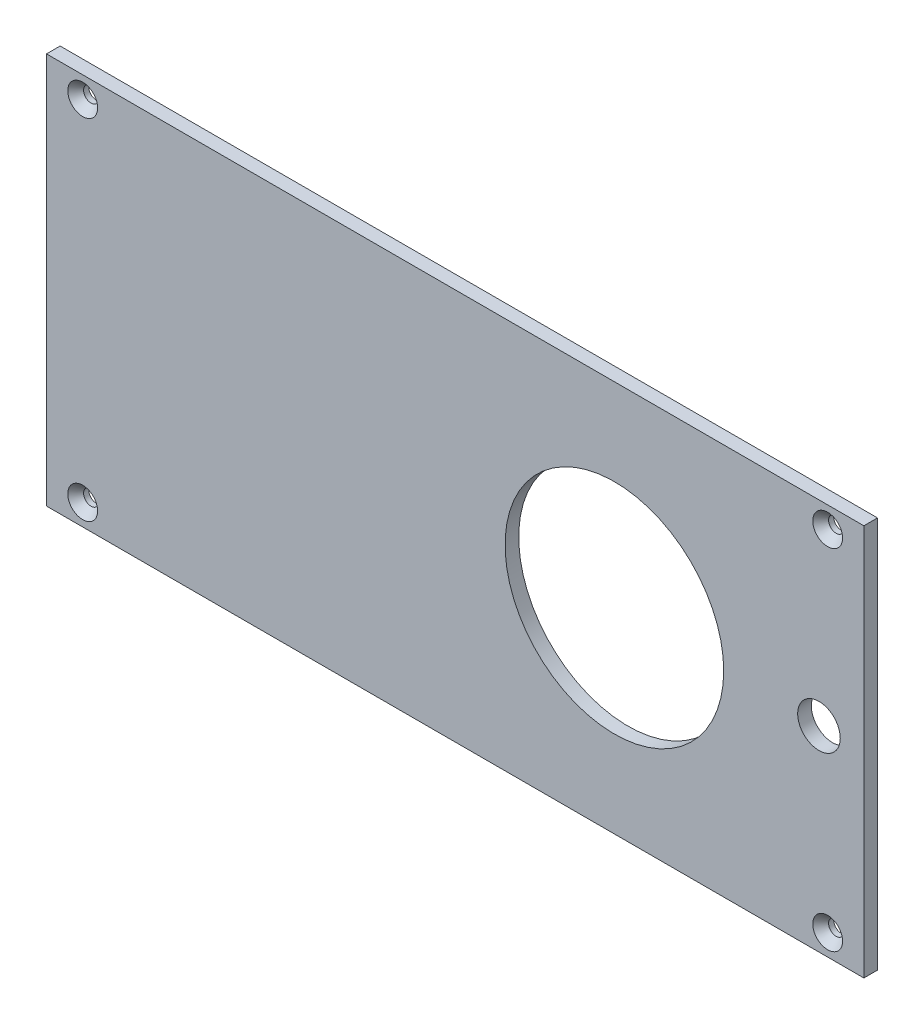
ISO-10303-21;
HEADER;
FILE_DESCRIPTION(('STEP AP214'),'2;1');
FILE_NAME('part.step','',(''),(''),'','','');
FILE_SCHEMA(('AUTOMOTIVE_DESIGN { 1 0 10303 214 1 1 1 1 }'));
ENDSEC;
DATA;
#1=APPLICATION_CONTEXT('core data for automotive mechanical design processes');
#2=APPLICATION_PROTOCOL_DEFINITION('international standard','automotive_design',2000,#1);
#3=PRODUCT_CONTEXT('',#1,'mechanical');
#4=PRODUCT('Part','Part','',(#3));
#5=PRODUCT_RELATED_PRODUCT_CATEGORY('part','',(#4));
#6=PRODUCT_DEFINITION_FORMATION('','',#4);
#7=PRODUCT_DEFINITION_CONTEXT('part definition',#1,'design');
#8=PRODUCT_DEFINITION('design','',#6,#7);
#9=PRODUCT_DEFINITION_SHAPE('','',#8);
#10=(LENGTH_UNIT() NAMED_UNIT(*) SI_UNIT(.MILLI.,.METRE.));
#11=(NAMED_UNIT(*) PLANE_ANGLE_UNIT() SI_UNIT($,.RADIAN.));
#12=(NAMED_UNIT(*) SI_UNIT($,.STERADIAN.) SOLID_ANGLE_UNIT());
#13=UNCERTAINTY_MEASURE_WITH_UNIT(LENGTH_MEASURE(1.E-05),#10,'distance_accuracy_value','');
#14=(GEOMETRIC_REPRESENTATION_CONTEXT(3) GLOBAL_UNCERTAINTY_ASSIGNED_CONTEXT((#13)) GLOBAL_UNIT_ASSIGNED_CONTEXT((#10,
#11,#12)) REPRESENTATION_CONTEXT('',''));
#15=CARTESIAN_POINT('',(0.,0.,0.));
#16=DIRECTION('',(0.,0.,1.));
#17=DIRECTION('',(1.,0.,0.));
#18=AXIS2_PLACEMENT_3D('',#15,#16,#17);
#19=CARTESIAN_POINT('',(0.,0.,1.6002));
#20=DIRECTION('',(1.,0.,0.));
#21=DIRECTION('',(0.,0.,-1.));
#22=AXIS2_PLACEMENT_3D('',#19,#20,#21);
#23=PLANE('',#22);
#24=DIRECTION('',(0.,-1.,0.));
#25=VECTOR('',#24,1.);
#26=CARTESIAN_POINT('',(0.,0.,0.));
#27=LINE('',#26,#25);
#28=CARTESIAN_POINT('',(0.,46.,0.));
#29=VERTEX_POINT('',#28);
#30=CARTESIAN_POINT('',(0.,0.,0.));
#31=VERTEX_POINT('',#30);
#32=EDGE_CURVE('E103',#29,#31,#27,.T.);
#33=ORIENTED_EDGE('',*,*,#32,.T.);
#34=DIRECTION('',(0.,0.,-1.));
#35=VECTOR('',#34,1.);
#36=CARTESIAN_POINT('',(0.,0.,1.6002));
#37=LINE('',#36,#35);
#38=CARTESIAN_POINT('',(0.,0.,1.6002));
#39=VERTEX_POINT('',#38);
#40=EDGE_CURVE('E11',#39,#31,#37,.T.);
#41=ORIENTED_EDGE('',*,*,#40,.F.);
#42=DIRECTION('',(0.,-1.,0.));
#43=VECTOR('',#42,1.);
#44=CARTESIAN_POINT('',(0.,0.,1.6002));
#45=LINE('',#44,#43);
#46=CARTESIAN_POINT('',(0.,46.,1.6002));
#47=VERTEX_POINT('',#46);
#48=EDGE_CURVE('E90',#47,#39,#45,.T.);
#49=ORIENTED_EDGE('',*,*,#48,.F.);
#50=DIRECTION('',(0.,0.,-1.));
#51=VECTOR('',#50,1.);
#52=CARTESIAN_POINT('',(0.,46.,1.6002));
#53=LINE('',#52,#51);
#54=EDGE_CURVE('E99',#47,#29,#53,.T.);
#55=ORIENTED_EDGE('',*,*,#54,.T.);
#56=EDGE_LOOP('',(#33,#41,#49,#55));
#57=FACE_BOUND('',#56,.T.);
#58=ADVANCED_FACE('F38',(#57),#23,.F.);
#59=CARTESIAN_POINT('',(0.,0.,1.6002));
#60=DIRECTION('',(0.,1.,0.));
#61=DIRECTION('',(0.,0.,1.));
#62=AXIS2_PLACEMENT_3D('',#59,#60,#61);
#63=PLANE('',#62);
#64=DIRECTION('',(1.,0.,0.));
#65=VECTOR('',#64,1.);
#66=CARTESIAN_POINT('',(0.,0.,0.));
#67=LINE('',#66,#65);
#68=CARTESIAN_POINT('',(96.,0.,0.));
#69=VERTEX_POINT('',#68);
#70=EDGE_CURVE('E94',#31,#69,#67,.T.);
#71=ORIENTED_EDGE('',*,*,#70,.T.);
#72=DIRECTION('',(0.,0.,-1.));
#73=VECTOR('',#72,1.);
#74=CARTESIAN_POINT('',(96.,0.,1.6002));
#75=LINE('',#74,#73);
#76=CARTESIAN_POINT('',(96.,0.,1.6002));
#77=VERTEX_POINT('',#76);
#78=EDGE_CURVE('E47',#77,#69,#75,.T.);
#79=ORIENTED_EDGE('',*,*,#78,.F.);
#80=DIRECTION('',(1.,0.,0.));
#81=VECTOR('',#80,1.);
#82=CARTESIAN_POINT('',(0.,0.,1.6002));
#83=LINE('',#82,#81);
#84=EDGE_CURVE('E85',#39,#77,#83,.T.);
#85=ORIENTED_EDGE('',*,*,#84,.F.);
#86=ORIENTED_EDGE('',*,*,#40,.T.);
#87=EDGE_LOOP('',(#71,#79,#85,#86));
#88=FACE_BOUND('',#87,.T.);
#89=ADVANCED_FACE('F93',(#88),#63,.F.);
#90=CARTESIAN_POINT('',(96.,0.,1.6002));
#91=DIRECTION('',(-1.,0.,0.));
#92=DIRECTION('',(0.,0.,1.));
#93=AXIS2_PLACEMENT_3D('',#90,#91,#92);
#94=PLANE('',#93);
#95=DIRECTION('',(0.,1.,0.));
#96=VECTOR('',#95,1.);
#97=CARTESIAN_POINT('',(96.,0.,0.));
#98=LINE('',#97,#96);
#99=CARTESIAN_POINT('',(96.,46.,0.));
#100=VERTEX_POINT('',#99);
#101=EDGE_CURVE('E72',#69,#100,#98,.T.);
#102=ORIENTED_EDGE('',*,*,#101,.T.);
#103=DIRECTION('',(0.,0.,-1.));
#104=VECTOR('',#103,1.);
#105=CARTESIAN_POINT('',(96.,46.,1.6002));
#106=LINE('',#105,#104);
#107=CARTESIAN_POINT('',(96.,46.,1.6002));
#108=VERTEX_POINT('',#107);
#109=EDGE_CURVE('E95',#108,#100,#106,.T.);
#110=ORIENTED_EDGE('',*,*,#109,.F.);
#111=DIRECTION('',(0.,1.,0.));
#112=VECTOR('',#111,1.);
#113=CARTESIAN_POINT('',(96.,0.,1.6002));
#114=LINE('',#113,#112);
#115=EDGE_CURVE('E88',#77,#108,#114,.T.);
#116=ORIENTED_EDGE('',*,*,#115,.F.);
#117=ORIENTED_EDGE('',*,*,#78,.T.);
#118=EDGE_LOOP('',(#102,#110,#116,#117));
#119=FACE_BOUND('',#118,.T.);
#120=ADVANCED_FACE('F97',(#119),#94,.F.);
#121=CARTESIAN_POINT('',(0.,46.,1.6002));
#122=DIRECTION('',(0.,-1.,0.));
#123=DIRECTION('',(0.,0.,-1.));
#124=AXIS2_PLACEMENT_3D('',#121,#122,#123);
#125=PLANE('',#124);
#126=DIRECTION('',(-1.,0.,0.));
#127=VECTOR('',#126,1.);
#128=CARTESIAN_POINT('',(0.,46.,0.));
#129=LINE('',#128,#127);
#130=EDGE_CURVE('E78',#100,#29,#129,.T.);
#131=ORIENTED_EDGE('',*,*,#130,.T.);
#132=ORIENTED_EDGE('',*,*,#54,.F.);
#133=DIRECTION('',(-1.,0.,0.));
#134=VECTOR('',#133,1.);
#135=CARTESIAN_POINT('',(0.,46.,1.6002));
#136=LINE('',#135,#134);
#137=EDGE_CURVE('E55',#108,#47,#136,.T.);
#138=ORIENTED_EDGE('',*,*,#137,.F.);
#139=ORIENTED_EDGE('',*,*,#109,.T.);
#140=EDGE_LOOP('',(#131,#132,#138,#139));
#141=FACE_BOUND('',#140,.T.);
#142=ADVANCED_FACE('F111',(#141),#125,.F.);
#143=CARTESIAN_POINT('',(0.,0.,1.6002));
#144=DIRECTION('',(0.,0.,-1.));
#145=DIRECTION('',(-1.,0.,0.));
#146=AXIS2_PLACEMENT_3D('',#143,#144,#145);
#147=PLANE('',#146);
#148=CARTESIAN_POINT('',(90.7270405436513,23.0000000000245,1.6002));
#149=DIRECTION('',(0.,0.,1.));
#150=DIRECTION('',(1.,0.,0.));
#151=AXIS2_PLACEMENT_3D('',#148,#149,#150);
#152=CIRCLE('',#151,2.50000000000001);
#153=CARTESIAN_POINT('',(93.2270405436513,23.0000000000245,1.6002));
#154=VERTEX_POINT('',#153);
#155=EDGE_CURVE('E158',#154,#154,#152,.T.);
#156=ORIENTED_EDGE('',*,*,#155,.F.);
#157=EDGE_LOOP('',(#156));
#158=FACE_BOUND('',#157,.T.);
#159=CARTESIAN_POINT('',(4.25,43.5,1.6002));
#160=DIRECTION('',(0.,0.,1.));
#161=DIRECTION('',(1.,0.,0.));
#162=AXIS2_PLACEMENT_3D('',#159,#160,#161);
#163=CIRCLE('',#162,1.7526);
#164=CARTESIAN_POINT('',(6.0026,43.5,1.6002));
#165=VERTEX_POINT('',#164);
#166=EDGE_CURVE('E155',#165,#165,#163,.T.);
#167=ORIENTED_EDGE('',*,*,#166,.F.);
#168=EDGE_LOOP('',(#167));
#169=FACE_BOUND('',#168,.T.);
#170=CARTESIAN_POINT('',(4.25000000000001,2.5,1.6002));
#171=DIRECTION('',(0.,0.,1.));
#172=DIRECTION('',(1.,0.,0.));
#173=AXIS2_PLACEMENT_3D('',#170,#171,#172);
#174=CIRCLE('',#173,1.7526);
#175=CARTESIAN_POINT('',(6.00260000000001,2.5,1.6002));
#176=VERTEX_POINT('',#175);
#177=EDGE_CURVE('E146',#176,#176,#174,.T.);
#178=ORIENTED_EDGE('',*,*,#177,.F.);
#179=EDGE_LOOP('',(#178));
#180=FACE_BOUND('',#179,.T.);
#181=CARTESIAN_POINT('',(91.75,2.50000000000002,1.6002));
#182=DIRECTION('',(0.,0.,1.));
#183=DIRECTION('',(1.,0.,0.));
#184=AXIS2_PLACEMENT_3D('',#181,#182,#183);
#185=CIRCLE('',#184,1.75259999999999);
#186=CARTESIAN_POINT('',(93.5026,2.50000000000002,1.6002));
#187=VERTEX_POINT('',#186);
#188=EDGE_CURVE('E137',#187,#187,#185,.T.);
#189=ORIENTED_EDGE('',*,*,#188,.F.);
#190=EDGE_LOOP('',(#189));
#191=FACE_BOUND('',#190,.T.);
#192=CARTESIAN_POINT('',(91.75,43.5,1.6002));
#193=DIRECTION('',(0.,0.,1.));
#194=DIRECTION('',(1.,0.,0.));
#195=AXIS2_PLACEMENT_3D('',#192,#193,#194);
#196=CIRCLE('',#195,1.75259999999999);
#197=CARTESIAN_POINT('',(93.5026,43.5,1.6002));
#198=VERTEX_POINT('',#197);
#199=EDGE_CURVE('E128',#198,#198,#196,.T.);
#200=ORIENTED_EDGE('',*,*,#199,.F.);
#201=EDGE_LOOP('',(#200));
#202=FACE_BOUND('',#201,.T.);
#203=CARTESIAN_POINT('',(66.7000000001694,23.0000000000244,1.6002));
#204=DIRECTION('',(0.,0.,1.));
#205=DIRECTION('',(1.,0.,0.));
#206=AXIS2_PLACEMENT_3D('',#203,#204,#205);
#207=CIRCLE('',#206,12.8397);
#208=CARTESIAN_POINT('',(79.5397000001694,23.0000000000244,1.6002));
#209=VERTEX_POINT('',#208);
#210=EDGE_CURVE('E117',#209,#209,#207,.T.);
#211=ORIENTED_EDGE('',*,*,#210,.F.);
#212=EDGE_LOOP('',(#211));
#213=FACE_BOUND('',#212,.T.);
#214=ORIENTED_EDGE('',*,*,#48,.T.);
#215=ORIENTED_EDGE('',*,*,#84,.T.);
#216=ORIENTED_EDGE('',*,*,#115,.T.);
#217=ORIENTED_EDGE('',*,*,#137,.T.);
#218=EDGE_LOOP('',(#214,#215,#216,#217));
#219=FACE_BOUND('',#218,.T.);
#220=ADVANCED_FACE('F86',(#158,#169,#180,#191,#202,#213,#219),#147,.F.);
#221=CARTESIAN_POINT('',(0.,0.,0.));
#222=DIRECTION('',(0.,0.,-1.));
#223=DIRECTION('',(-1.,0.,0.));
#224=AXIS2_PLACEMENT_3D('',#221,#222,#223);
#225=PLANE('',#224);
#226=CARTESIAN_POINT('',(90.7270405436513,23.0000000000245,0.));
#227=DIRECTION('',(0.,0.,-1.));
#228=DIRECTION('',(-1.,0.,0.));
#229=AXIS2_PLACEMENT_3D('',#226,#227,#228);
#230=CIRCLE('',#229,2.50000000000001);
#231=CARTESIAN_POINT('',(88.2270405436513,23.0000000000245,0.));
#232=VERTEX_POINT('',#231);
#233=EDGE_CURVE('E41',#232,#232,#230,.T.);
#234=ORIENTED_EDGE('',*,*,#233,.F.);
#235=EDGE_LOOP('',(#234));
#236=FACE_BOUND('',#235,.T.);
#237=CARTESIAN_POINT('',(4.25,43.5,0.));
#238=DIRECTION('',(0.,0.,1.));
#239=DIRECTION('',(1.,0.,0.));
#240=AXIS2_PLACEMENT_3D('',#237,#238,#239);
#241=CIRCLE('',#240,0.888999999999999);
#242=CARTESIAN_POINT('',(5.139,43.5,0.));
#243=VERTEX_POINT('',#242);
#244=EDGE_CURVE('E149',#243,#243,#241,.T.);
#245=ORIENTED_EDGE('',*,*,#244,.T.);
#246=EDGE_LOOP('',(#245));
#247=FACE_BOUND('',#246,.T.);
#248=CARTESIAN_POINT('',(4.25000000000001,2.5,0.));
#249=DIRECTION('',(0.,0.,1.));
#250=DIRECTION('',(1.,0.,0.));
#251=AXIS2_PLACEMENT_3D('',#248,#249,#250);
#252=CIRCLE('',#251,0.888999999999999);
#253=CARTESIAN_POINT('',(5.139,2.5,0.));
#254=VERTEX_POINT('',#253);
#255=EDGE_CURVE('E140',#254,#254,#252,.T.);
#256=ORIENTED_EDGE('',*,*,#255,.T.);
#257=EDGE_LOOP('',(#256));
#258=FACE_BOUND('',#257,.T.);
#259=CARTESIAN_POINT('',(91.75,2.50000000000002,0.));
#260=DIRECTION('',(0.,0.,1.));
#261=DIRECTION('',(1.,0.,0.));
#262=AXIS2_PLACEMENT_3D('',#259,#260,#261);
#263=CIRCLE('',#262,0.889000000000001);
#264=CARTESIAN_POINT('',(92.639,2.50000000000002,0.));
#265=VERTEX_POINT('',#264);
#266=EDGE_CURVE('E131',#265,#265,#263,.T.);
#267=ORIENTED_EDGE('',*,*,#266,.T.);
#268=EDGE_LOOP('',(#267));
#269=FACE_BOUND('',#268,.T.);
#270=CARTESIAN_POINT('',(91.75,43.5,0.));
#271=DIRECTION('',(0.,0.,1.));
#272=DIRECTION('',(1.,0.,0.));
#273=AXIS2_PLACEMENT_3D('',#270,#271,#272);
#274=CIRCLE('',#273,0.889000000000001);
#275=CARTESIAN_POINT('',(92.639,43.5,0.));
#276=VERTEX_POINT('',#275);
#277=EDGE_CURVE('E120',#276,#276,#274,.T.);
#278=ORIENTED_EDGE('',*,*,#277,.T.);
#279=EDGE_LOOP('',(#278));
#280=FACE_BOUND('',#279,.T.);
#281=CARTESIAN_POINT('',(66.7000000001694,23.0000000000244,0.));
#282=DIRECTION('',(0.,0.,1.));
#283=DIRECTION('',(1.,0.,0.));
#284=AXIS2_PLACEMENT_3D('',#281,#282,#283);
#285=CIRCLE('',#284,12.8397);
#286=CARTESIAN_POINT('',(79.5397000001694,23.0000000000244,0.));
#287=VERTEX_POINT('',#286);
#288=EDGE_CURVE('E106',#287,#287,#285,.T.);
#289=ORIENTED_EDGE('',*,*,#288,.T.);
#290=EDGE_LOOP('',(#289));
#291=FACE_BOUND('',#290,.T.);
#292=ORIENTED_EDGE('',*,*,#32,.F.);
#293=ORIENTED_EDGE('',*,*,#130,.F.);
#294=ORIENTED_EDGE('',*,*,#101,.F.);
#295=ORIENTED_EDGE('',*,*,#70,.F.);
#296=EDGE_LOOP('',(#292,#293,#294,#295));
#297=FACE_BOUND('',#296,.T.);
#298=ADVANCED_FACE('F114',(#236,#247,#258,#269,#280,#291,#297),#225,.T.);
#299=CARTESIAN_POINT('',(66.7000000001694,23.0000000000244,0.));
#300=DIRECTION('',(0.,0.,1.));
#301=DIRECTION('',(1.,0.,0.));
#302=AXIS2_PLACEMENT_3D('',#299,#300,#301);
#303=CYLINDRICAL_SURFACE('',#302,12.8397);
#304=ORIENTED_EDGE('',*,*,#288,.F.);
#305=EDGE_LOOP('',(#304));
#306=FACE_BOUND('',#305,.T.);
#307=ORIENTED_EDGE('',*,*,#210,.T.);
#308=EDGE_LOOP('',(#307));
#309=FACE_BOUND('',#308,.T.);
#310=ADVANCED_FACE('F169',(#306,#309),#303,.F.);
#311=CARTESIAN_POINT('',(91.75,43.5,1.6002));
#312=DIRECTION('',(0.,0.,1.));
#313=DIRECTION('',(1.,0.,0.));
#314=AXIS2_PLACEMENT_3D('',#311,#312,#313);
#315=CYLINDRICAL_SURFACE('',#314,0.889000000000001);
#316=ORIENTED_EDGE('',*,*,#277,.F.);
#317=EDGE_LOOP('',(#316));
#318=FACE_BOUND('',#317,.T.);
#319=CARTESIAN_POINT('',(91.75,43.5,0.606741843523936));
#320=DIRECTION('',(0.,0.,1.));
#321=DIRECTION('',(1.,0.,0.));
#322=AXIS2_PLACEMENT_3D('',#319,#320,#321);
#323=CIRCLE('',#322,0.889000000000001);
#324=CARTESIAN_POINT('',(92.639,43.5,0.606741843523936));
#325=VERTEX_POINT('',#324);
#326=EDGE_CURVE('E125',#325,#325,#323,.T.);
#327=ORIENTED_EDGE('',*,*,#326,.T.);
#328=EDGE_LOOP('',(#327));
#329=FACE_BOUND('',#328,.T.);
#330=ADVANCED_FACE('F183',(#318,#329),#315,.F.);
#331=CARTESIAN_POINT('',(91.75,43.5,1.6002));
#332=DIRECTION('',(0.,0.,1.));
#333=DIRECTION('',(1.,0.,0.));
#334=AXIS2_PLACEMENT_3D('',#331,#332,#333);
#335=CONICAL_SURFACE('',#334,1.75259999999999,0.715584993317671);
#336=ORIENTED_EDGE('',*,*,#326,.F.);
#337=EDGE_LOOP('',(#336));
#338=FACE_BOUND('',#337,.T.);
#339=ORIENTED_EDGE('',*,*,#199,.T.);
#340=EDGE_LOOP('',(#339));
#341=FACE_BOUND('',#340,.T.);
#342=ADVANCED_FACE('F227',(#338,#341),#335,.F.);
#343=CARTESIAN_POINT('',(91.75,2.50000000000002,1.6002));
#344=DIRECTION('',(0.,0.,1.));
#345=DIRECTION('',(1.,0.,0.));
#346=AXIS2_PLACEMENT_3D('',#343,#344,#345);
#347=CYLINDRICAL_SURFACE('',#346,0.889000000000001);
#348=ORIENTED_EDGE('',*,*,#266,.F.);
#349=EDGE_LOOP('',(#348));
#350=FACE_BOUND('',#349,.T.);
#351=CARTESIAN_POINT('',(91.75,2.50000000000002,0.606741843523936));
#352=DIRECTION('',(0.,0.,1.));
#353=DIRECTION('',(1.,0.,0.));
#354=AXIS2_PLACEMENT_3D('',#351,#352,#353);
#355=CIRCLE('',#354,0.889000000000001);
#356=CARTESIAN_POINT('',(92.639,2.50000000000002,0.606741843523936));
#357=VERTEX_POINT('',#356);
#358=EDGE_CURVE('E134',#357,#357,#355,.T.);
#359=ORIENTED_EDGE('',*,*,#358,.T.);
#360=EDGE_LOOP('',(#359));
#361=FACE_BOUND('',#360,.T.);
#362=ADVANCED_FACE('F239',(#350,#361),#347,.F.);
#363=CARTESIAN_POINT('',(91.75,2.50000000000002,1.6002));
#364=DIRECTION('',(0.,0.,1.));
#365=DIRECTION('',(1.,0.,0.));
#366=AXIS2_PLACEMENT_3D('',#363,#364,#365);
#367=CONICAL_SURFACE('',#366,1.75259999999999,0.715584993317671);
#368=ORIENTED_EDGE('',*,*,#358,.F.);
#369=EDGE_LOOP('',(#368));
#370=FACE_BOUND('',#369,.T.);
#371=ORIENTED_EDGE('',*,*,#188,.T.);
#372=EDGE_LOOP('',(#371));
#373=FACE_BOUND('',#372,.T.);
#374=ADVANCED_FACE('F250',(#370,#373),#367,.F.);
#375=CARTESIAN_POINT('',(4.25000000000001,2.5,1.6002));
#376=DIRECTION('',(0.,0.,1.));
#377=DIRECTION('',(1.,0.,0.));
#378=AXIS2_PLACEMENT_3D('',#375,#376,#377);
#379=CYLINDRICAL_SURFACE('',#378,0.889);
#380=ORIENTED_EDGE('',*,*,#255,.F.);
#381=EDGE_LOOP('',(#380));
#382=FACE_BOUND('',#381,.T.);
#383=CARTESIAN_POINT('',(4.25000000000001,2.5,0.606741843523936));
#384=DIRECTION('',(0.,0.,1.));
#385=DIRECTION('',(1.,0.,0.));
#386=AXIS2_PLACEMENT_3D('',#383,#384,#385);
#387=CIRCLE('',#386,0.889);
#388=CARTESIAN_POINT('',(5.13900000000001,2.5,0.606741843523936));
#389=VERTEX_POINT('',#388);
#390=EDGE_CURVE('E143',#389,#389,#387,.T.);
#391=ORIENTED_EDGE('',*,*,#390,.T.);
#392=EDGE_LOOP('',(#391));
#393=FACE_BOUND('',#392,.T.);
#394=ADVANCED_FACE('F261',(#382,#393),#379,.F.);
#395=CARTESIAN_POINT('',(4.25000000000001,2.5,1.6002));
#396=DIRECTION('',(0.,0.,1.));
#397=DIRECTION('',(1.,0.,0.));
#398=AXIS2_PLACEMENT_3D('',#395,#396,#397);
#399=CONICAL_SURFACE('',#398,1.7526,0.715584993317675);
#400=ORIENTED_EDGE('',*,*,#390,.F.);
#401=EDGE_LOOP('',(#400));
#402=FACE_BOUND('',#401,.T.);
#403=ORIENTED_EDGE('',*,*,#177,.T.);
#404=EDGE_LOOP('',(#403));
#405=FACE_BOUND('',#404,.T.);
#406=ADVANCED_FACE('F272',(#402,#405),#399,.F.);
#407=CARTESIAN_POINT('',(4.25,43.5,1.6002));
#408=DIRECTION('',(0.,0.,1.));
#409=DIRECTION('',(1.,0.,0.));
#410=AXIS2_PLACEMENT_3D('',#407,#408,#409);
#411=CYLINDRICAL_SURFACE('',#410,0.889);
#412=ORIENTED_EDGE('',*,*,#244,.F.);
#413=EDGE_LOOP('',(#412));
#414=FACE_BOUND('',#413,.T.);
#415=CARTESIAN_POINT('',(4.25,43.5,0.606741843523936));
#416=DIRECTION('',(0.,0.,1.));
#417=DIRECTION('',(1.,0.,0.));
#418=AXIS2_PLACEMENT_3D('',#415,#416,#417);
#419=CIRCLE('',#418,0.889);
#420=CARTESIAN_POINT('',(5.139,43.5,0.606741843523936));
#421=VERTEX_POINT('',#420);
#422=EDGE_CURVE('E152',#421,#421,#419,.T.);
#423=ORIENTED_EDGE('',*,*,#422,.T.);
#424=EDGE_LOOP('',(#423));
#425=FACE_BOUND('',#424,.T.);
#426=ADVANCED_FACE('F283',(#414,#425),#411,.F.);
#427=CARTESIAN_POINT('',(4.25,43.5,1.6002));
#428=DIRECTION('',(0.,0.,1.));
#429=DIRECTION('',(1.,0.,0.));
#430=AXIS2_PLACEMENT_3D('',#427,#428,#429);
#431=CONICAL_SURFACE('',#430,1.7526,0.715584993317675);
#432=ORIENTED_EDGE('',*,*,#422,.F.);
#433=EDGE_LOOP('',(#432));
#434=FACE_BOUND('',#433,.T.);
#435=ORIENTED_EDGE('',*,*,#166,.T.);
#436=EDGE_LOOP('',(#435));
#437=FACE_BOUND('',#436,.T.);
#438=ADVANCED_FACE('F294',(#434,#437),#431,.F.);
#439=CARTESIAN_POINT('',(90.7270405436513,23.0000000000245,-8.3998));
#440=DIRECTION('',(0.,0.,1.));
#441=DIRECTION('',(1.,0.,0.));
#442=AXIS2_PLACEMENT_3D('',#439,#440,#441);
#443=CYLINDRICAL_SURFACE('',#442,2.50000000000001);
#444=ORIENTED_EDGE('',*,*,#233,.T.);
#445=EDGE_LOOP('',(#444));
#446=FACE_BOUND('',#445,.T.);
#447=ORIENTED_EDGE('',*,*,#155,.T.);
#448=EDGE_LOOP('',(#447));
#449=FACE_BOUND('',#448,.T.);
#450=ADVANCED_FACE('F165',(#446,#449),#443,.F.);
#451=CLOSED_SHELL('',(#58,#89,#120,#142,#220,#298,#310,#330,#342,#362,#374,#394,#406,#426,#438,#450));
#452=MANIFOLD_SOLID_BREP('B2',#451);
#453=ADVANCED_BREP_SHAPE_REPRESENTATION('',(#18,#452),#14);
#454=SHAPE_DEFINITION_REPRESENTATION(#9,#453);
ENDSEC;
END-ISO-10303-21;
